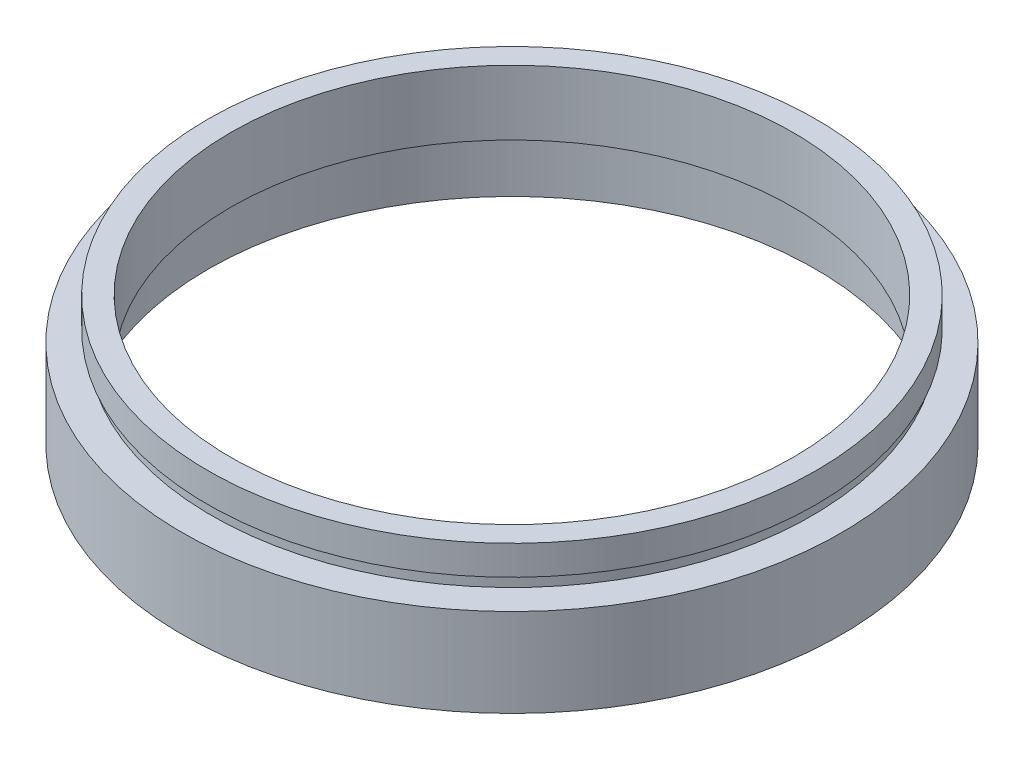
ISO-10303-21;
HEADER;
FILE_DESCRIPTION(('STEP AP214'),'2;1');
FILE_NAME('part.step','',(''),(''),'','','');
FILE_SCHEMA(('AUTOMOTIVE_DESIGN { 1 0 10303 214 1 1 1 1 }'));
ENDSEC;
DATA;
#1=APPLICATION_CONTEXT('core data for automotive mechanical design processes');
#2=APPLICATION_PROTOCOL_DEFINITION('international standard','automotive_design',2000,#1);
#3=PRODUCT_CONTEXT('',#1,'mechanical');
#4=PRODUCT('Part','Part','',(#3));
#5=PRODUCT_RELATED_PRODUCT_CATEGORY('part','',(#4));
#6=PRODUCT_DEFINITION_FORMATION('','',#4);
#7=PRODUCT_DEFINITION_CONTEXT('part definition',#1,'design');
#8=PRODUCT_DEFINITION('design','',#6,#7);
#9=PRODUCT_DEFINITION_SHAPE('','',#8);
#10=(LENGTH_UNIT() NAMED_UNIT(*) SI_UNIT(.MILLI.,.METRE.));
#11=(NAMED_UNIT(*) PLANE_ANGLE_UNIT() SI_UNIT($,.RADIAN.));
#12=(NAMED_UNIT(*) SI_UNIT($,.STERADIAN.) SOLID_ANGLE_UNIT());
#13=UNCERTAINTY_MEASURE_WITH_UNIT(LENGTH_MEASURE(1.E-05),#10,'distance_accuracy_value','');
#14=(GEOMETRIC_REPRESENTATION_CONTEXT(3) GLOBAL_UNCERTAINTY_ASSIGNED_CONTEXT((#13)) GLOBAL_UNIT_ASSIGNED_CONTEXT((#10,
#11,#12)) REPRESENTATION_CONTEXT('',''));
#15=CARTESIAN_POINT('',(0.,0.,0.));
#16=DIRECTION('',(0.,0.,1.));
#17=DIRECTION('',(1.,0.,0.));
#18=AXIS2_PLACEMENT_3D('',#15,#16,#17);
#19=CARTESIAN_POINT('',(28.,0.,0.));
#20=DIRECTION('',(0.,1.,0.));
#21=DIRECTION('',(-1.,0.,0.));
#22=AXIS2_PLACEMENT_3D('',#19,#20,#21);
#23=PLANE('',#22);
#24=CARTESIAN_POINT('',(0.,0.,0.));
#25=DIRECTION('',(0.,1.,0.));
#26=DIRECTION('',(-1.,0.,0.));
#27=AXIS2_PLACEMENT_3D('',#24,#25,#26);
#28=CIRCLE('',#27,28.);
#29=CARTESIAN_POINT('',(-28.,0.,0.));
#30=VERTEX_POINT('',#29);
#31=EDGE_CURVE('E77',#30,#30,#28,.T.);
#32=ORIENTED_EDGE('',*,*,#31,.F.);
#33=EDGE_LOOP('',(#32));
#34=FACE_BOUND('',#33,.T.);
#35=CARTESIAN_POINT('',(0.,0.,0.));
#36=DIRECTION('',(0.,1.,0.));
#37=DIRECTION('',(-1.,0.,0.));
#38=AXIS2_PLACEMENT_3D('',#35,#36,#37);
#39=CIRCLE('',#38,25.8);
#40=CARTESIAN_POINT('',(-25.8,0.,0.));
#41=VERTEX_POINT('',#40);
#42=EDGE_CURVE('E10',#41,#41,#39,.T.);
#43=ORIENTED_EDGE('',*,*,#42,.T.);
#44=EDGE_LOOP('',(#43));
#45=FACE_BOUND('',#44,.T.);
#46=ADVANCED_FACE('F37',(#34,#45),#23,.F.);
#47=CARTESIAN_POINT('',(0.,16.8860182370821,0.));
#48=DIRECTION('',(0.,1.,0.));
#49=DIRECTION('',(-1.,0.,0.));
#50=AXIS2_PLACEMENT_3D('',#47,#48,#49);
#51=CYLINDRICAL_SURFACE('',#50,25.8);
#52=ORIENTED_EDGE('',*,*,#42,.F.);
#53=EDGE_LOOP('',(#52));
#54=FACE_BOUND('',#53,.T.);
#55=CARTESIAN_POINT('',(0.,4.5,0.));
#56=DIRECTION('',(0.,1.,0.));
#57=DIRECTION('',(-1.,0.,0.));
#58=AXIS2_PLACEMENT_3D('',#55,#56,#57);
#59=CIRCLE('',#58,25.8);
#60=CARTESIAN_POINT('',(-25.8,4.49999999999999,0.));
#61=VERTEX_POINT('',#60);
#62=EDGE_CURVE('E43',#61,#61,#59,.T.);
#63=ORIENTED_EDGE('',*,*,#62,.T.);
#64=EDGE_LOOP('',(#63));
#65=FACE_BOUND('',#64,.T.);
#66=ADVANCED_FACE('F84',(#54,#65),#51,.F.);
#67=CARTESIAN_POINT('',(25.8,4.5,0.));
#68=DIRECTION('',(0.,-1.,0.));
#69=DIRECTION('',(1.,0.,0.));
#70=AXIS2_PLACEMENT_3D('',#67,#68,#69);
#71=PLANE('',#70);
#72=ORIENTED_EDGE('',*,*,#62,.F.);
#73=EDGE_LOOP('',(#72));
#74=FACE_BOUND('',#73,.T.);
#75=CARTESIAN_POINT('',(0.,4.5,0.));
#76=DIRECTION('',(0.,1.,0.));
#77=DIRECTION('',(-1.,0.,0.));
#78=AXIS2_PLACEMENT_3D('',#75,#76,#77);
#79=CIRCLE('',#78,26.1);
#80=CARTESIAN_POINT('',(-26.1,4.49999999999999,0.));
#81=VERTEX_POINT('',#80);
#82=EDGE_CURVE('E47',#81,#81,#79,.T.);
#83=ORIENTED_EDGE('',*,*,#82,.T.);
#84=EDGE_LOOP('',(#83));
#85=FACE_BOUND('',#84,.T.);
#86=ADVANCED_FACE('F88',(#74,#85),#71,.F.);
#87=CARTESIAN_POINT('',(0.,16.8860182370821,0.));
#88=DIRECTION('',(0.,1.,0.));
#89=DIRECTION('',(-1.,0.,0.));
#90=AXIS2_PLACEMENT_3D('',#87,#88,#89);
#91=CYLINDRICAL_SURFACE('',#90,26.1);
#92=ORIENTED_EDGE('',*,*,#82,.F.);
#93=EDGE_LOOP('',(#92));
#94=FACE_BOUND('',#93,.T.);
#95=CARTESIAN_POINT('',(0.,5.5,0.));
#96=DIRECTION('',(0.,1.,0.));
#97=DIRECTION('',(-1.,0.,0.));
#98=AXIS2_PLACEMENT_3D('',#95,#96,#97);
#99=CIRCLE('',#98,26.1);
#100=CARTESIAN_POINT('',(-26.1,5.49999999999999,0.));
#101=VERTEX_POINT('',#100);
#102=EDGE_CURVE('E51',#101,#101,#99,.T.);
#103=ORIENTED_EDGE('',*,*,#102,.T.);
#104=EDGE_LOOP('',(#103));
#105=FACE_BOUND('',#104,.T.);
#106=ADVANCED_FACE('F93',(#94,#105),#91,.F.);
#107=CARTESIAN_POINT('',(23.9,5.5,0.));
#108=DIRECTION('',(0.,1.,0.));
#109=DIRECTION('',(-1.,0.,0.));
#110=AXIS2_PLACEMENT_3D('',#107,#108,#109);
#111=PLANE('',#110);
#112=ORIENTED_EDGE('',*,*,#102,.F.);
#113=EDGE_LOOP('',(#112));
#114=FACE_BOUND('',#113,.T.);
#115=CARTESIAN_POINT('',(0.,5.5,0.));
#116=DIRECTION('',(0.,1.,0.));
#117=DIRECTION('',(-1.,0.,0.));
#118=AXIS2_PLACEMENT_3D('',#115,#116,#117);
#119=CIRCLE('',#118,23.9);
#120=CARTESIAN_POINT('',(-23.9,5.49999999999999,0.));
#121=VERTEX_POINT('',#120);
#122=EDGE_CURVE('E56',#121,#121,#119,.T.);
#123=ORIENTED_EDGE('',*,*,#122,.T.);
#124=EDGE_LOOP('',(#123));
#125=FACE_BOUND('',#124,.T.);
#126=ADVANCED_FACE('F99',(#114,#125),#111,.F.);
#127=CARTESIAN_POINT('',(0.,16.8860182370821,0.));
#128=DIRECTION('',(0.,1.,0.));
#129=DIRECTION('',(-1.,0.,0.));
#130=AXIS2_PLACEMENT_3D('',#127,#128,#129);
#131=CYLINDRICAL_SURFACE('',#130,23.9);
#132=ORIENTED_EDGE('',*,*,#122,.F.);
#133=EDGE_LOOP('',(#132));
#134=FACE_BOUND('',#133,.T.);
#135=CARTESIAN_POINT('',(0.,11.,0.));
#136=DIRECTION('',(0.,1.,0.));
#137=DIRECTION('',(-1.,0.,0.));
#138=AXIS2_PLACEMENT_3D('',#135,#136,#137);
#139=CIRCLE('',#138,23.9);
#140=CARTESIAN_POINT('',(-23.9,11.,0.));
#141=VERTEX_POINT('',#140);
#142=EDGE_CURVE('E59',#141,#141,#139,.T.);
#143=ORIENTED_EDGE('',*,*,#142,.T.);
#144=EDGE_LOOP('',(#143));
#145=FACE_BOUND('',#144,.T.);
#146=ADVANCED_FACE('F103',(#134,#145),#131,.F.);
#147=CARTESIAN_POINT('',(23.9,11.,0.));
#148=DIRECTION('',(0.,-1.,0.));
#149=DIRECTION('',(1.,0.,0.));
#150=AXIS2_PLACEMENT_3D('',#147,#148,#149);
#151=PLANE('',#150);
#152=ORIENTED_EDGE('',*,*,#142,.F.);
#153=EDGE_LOOP('',(#152));
#154=FACE_BOUND('',#153,.T.);
#155=CARTESIAN_POINT('',(0.,11.,0.));
#156=DIRECTION('',(0.,1.,0.));
#157=DIRECTION('',(-1.,0.,0.));
#158=AXIS2_PLACEMENT_3D('',#155,#156,#157);
#159=CIRCLE('',#158,25.85);
#160=CARTESIAN_POINT('',(-25.85,11.,0.));
#161=VERTEX_POINT('',#160);
#162=EDGE_CURVE('E62',#161,#161,#159,.T.);
#163=ORIENTED_EDGE('',*,*,#162,.T.);
#164=EDGE_LOOP('',(#163));
#165=FACE_BOUND('',#164,.T.);
#166=ADVANCED_FACE('F107',(#154,#165),#151,.F.);
#167=CARTESIAN_POINT('',(0.,16.8860182370821,0.));
#168=DIRECTION('',(0.,1.,0.));
#169=DIRECTION('',(-1.,0.,0.));
#170=AXIS2_PLACEMENT_3D('',#167,#168,#169);
#171=CYLINDRICAL_SURFACE('',#170,25.85);
#172=ORIENTED_EDGE('',*,*,#162,.F.);
#173=EDGE_LOOP('',(#172));
#174=FACE_BOUND('',#173,.T.);
#175=CARTESIAN_POINT('',(0.,8.5,0.));
#176=DIRECTION('',(0.,1.,0.));
#177=DIRECTION('',(-1.,0.,0.));
#178=AXIS2_PLACEMENT_3D('',#175,#176,#177);
#179=CIRCLE('',#178,25.85);
#180=CARTESIAN_POINT('',(-25.85,8.49999999999999,0.));
#181=VERTEX_POINT('',#180);
#182=EDGE_CURVE('E65',#181,#181,#179,.T.);
#183=ORIENTED_EDGE('',*,*,#182,.T.);
#184=EDGE_LOOP('',(#183));
#185=FACE_BOUND('',#184,.T.);
#186=ADVANCED_FACE('F111',(#174,#185),#171,.T.);
#187=CARTESIAN_POINT('',(25.85,8.5,0.));
#188=DIRECTION('',(0.,1.,0.));
#189=DIRECTION('',(-1.,0.,0.));
#190=AXIS2_PLACEMENT_3D('',#187,#188,#189);
#191=PLANE('',#190);
#192=ORIENTED_EDGE('',*,*,#182,.F.);
#193=EDGE_LOOP('',(#192));
#194=FACE_BOUND('',#193,.T.);
#195=CARTESIAN_POINT('',(0.,8.5,0.));
#196=DIRECTION('',(0.,1.,0.));
#197=DIRECTION('',(-1.,0.,0.));
#198=AXIS2_PLACEMENT_3D('',#195,#196,#197);
#199=CIRCLE('',#198,25.5);
#200=CARTESIAN_POINT('',(-25.5,8.49999999999999,0.));
#201=VERTEX_POINT('',#200);
#202=EDGE_CURVE('E68',#201,#201,#199,.T.);
#203=ORIENTED_EDGE('',*,*,#202,.T.);
#204=EDGE_LOOP('',(#203));
#205=FACE_BOUND('',#204,.T.);
#206=ADVANCED_FACE('F115',(#194,#205),#191,.F.);
#207=CARTESIAN_POINT('',(0.,16.8860182370821,0.));
#208=DIRECTION('',(0.,1.,0.));
#209=DIRECTION('',(-1.,0.,0.));
#210=AXIS2_PLACEMENT_3D('',#207,#208,#209);
#211=CYLINDRICAL_SURFACE('',#210,25.5);
#212=ORIENTED_EDGE('',*,*,#202,.F.);
#213=EDGE_LOOP('',(#212));
#214=FACE_BOUND('',#213,.T.);
#215=CARTESIAN_POINT('',(0.,7.5,0.));
#216=DIRECTION('',(0.,1.,0.));
#217=DIRECTION('',(-1.,0.,0.));
#218=AXIS2_PLACEMENT_3D('',#215,#216,#217);
#219=CIRCLE('',#218,25.5);
#220=CARTESIAN_POINT('',(-25.5,7.49999999999999,0.));
#221=VERTEX_POINT('',#220);
#222=EDGE_CURVE('E71',#221,#221,#219,.T.);
#223=ORIENTED_EDGE('',*,*,#222,.T.);
#224=EDGE_LOOP('',(#223));
#225=FACE_BOUND('',#224,.T.);
#226=ADVANCED_FACE('F119',(#214,#225),#211,.T.);
#227=CARTESIAN_POINT('',(25.5,7.5,0.));
#228=DIRECTION('',(0.,-1.,0.));
#229=DIRECTION('',(1.,0.,0.));
#230=AXIS2_PLACEMENT_3D('',#227,#228,#229);
#231=PLANE('',#230);
#232=ORIENTED_EDGE('',*,*,#222,.F.);
#233=EDGE_LOOP('',(#232));
#234=FACE_BOUND('',#233,.T.);
#235=CARTESIAN_POINT('',(0.,7.5,0.));
#236=DIRECTION('',(0.,1.,0.));
#237=DIRECTION('',(-1.,0.,0.));
#238=AXIS2_PLACEMENT_3D('',#235,#236,#237);
#239=CIRCLE('',#238,28.);
#240=CARTESIAN_POINT('',(-28.,7.49999999999999,0.));
#241=VERTEX_POINT('',#240);
#242=EDGE_CURVE('E74',#241,#241,#239,.T.);
#243=ORIENTED_EDGE('',*,*,#242,.T.);
#244=EDGE_LOOP('',(#243));
#245=FACE_BOUND('',#244,.T.);
#246=ADVANCED_FACE('F123',(#234,#245),#231,.F.);
#247=CARTESIAN_POINT('',(0.,16.8860182370821,0.));
#248=DIRECTION('',(0.,1.,0.));
#249=DIRECTION('',(-1.,0.,0.));
#250=AXIS2_PLACEMENT_3D('',#247,#248,#249);
#251=CYLINDRICAL_SURFACE('',#250,28.);
#252=ORIENTED_EDGE('',*,*,#242,.F.);
#253=EDGE_LOOP('',(#252));
#254=FACE_BOUND('',#253,.T.);
#255=ORIENTED_EDGE('',*,*,#31,.T.);
#256=EDGE_LOOP('',(#255));
#257=FACE_BOUND('',#256,.T.);
#258=ADVANCED_FACE('F81',(#254,#257),#251,.T.);
#259=CLOSED_SHELL('',(#46,#66,#86,#106,#126,#146,#166,#186,#206,#226,#246,#258));
#260=MANIFOLD_SOLID_BREP('B2',#259);
#261=ADVANCED_BREP_SHAPE_REPRESENTATION('',(#18,#260),#14);
#262=SHAPE_DEFINITION_REPRESENTATION(#9,#261);
ENDSEC;
END-ISO-10303-21;
